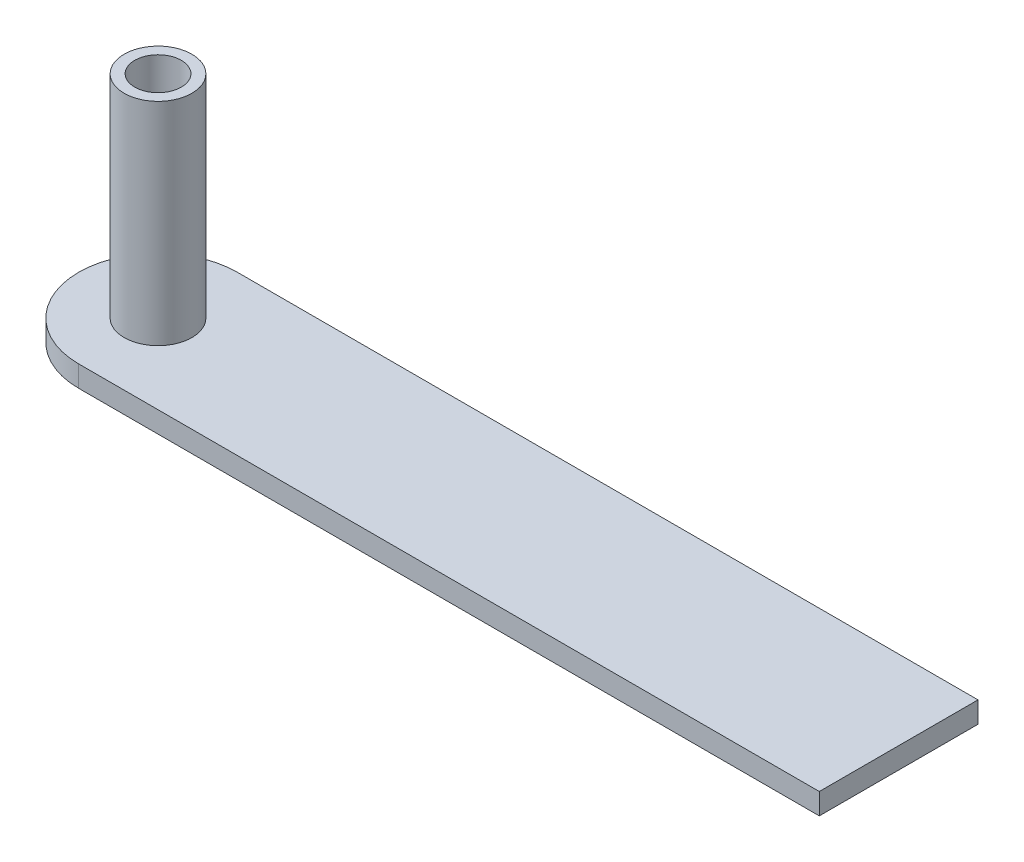
ISO-10303-21;
HEADER;
FILE_DESCRIPTION(('STEP AP214'),'2;1');
FILE_NAME('part.step','',(''),(''),'','','');
FILE_SCHEMA(('AUTOMOTIVE_DESIGN { 1 0 10303 214 1 1 1 1 }'));
ENDSEC;
DATA;
#1=APPLICATION_CONTEXT('core data for automotive mechanical design processes');
#2=APPLICATION_PROTOCOL_DEFINITION('international standard','automotive_design',2000,#1);
#3=PRODUCT_CONTEXT('',#1,'mechanical');
#4=PRODUCT('Part','Part','',(#3));
#5=PRODUCT_RELATED_PRODUCT_CATEGORY('part','',(#4));
#6=PRODUCT_DEFINITION_FORMATION('','',#4);
#7=PRODUCT_DEFINITION_CONTEXT('part definition',#1,'design');
#8=PRODUCT_DEFINITION('design','',#6,#7);
#9=PRODUCT_DEFINITION_SHAPE('','',#8);
#10=(LENGTH_UNIT() NAMED_UNIT(*) SI_UNIT(.MILLI.,.METRE.));
#11=(NAMED_UNIT(*) PLANE_ANGLE_UNIT() SI_UNIT($,.RADIAN.));
#12=(NAMED_UNIT(*) SI_UNIT($,.STERADIAN.) SOLID_ANGLE_UNIT());
#13=UNCERTAINTY_MEASURE_WITH_UNIT(LENGTH_MEASURE(1.E-05),#10,'distance_accuracy_value','');
#14=(GEOMETRIC_REPRESENTATION_CONTEXT(3) GLOBAL_UNCERTAINTY_ASSIGNED_CONTEXT((#13)) GLOBAL_UNIT_ASSIGNED_CONTEXT((#10,
#11,#12)) REPRESENTATION_CONTEXT('',''));
#15=CARTESIAN_POINT('',(0.,0.,0.));
#16=DIRECTION('',(0.,0.,1.));
#17=DIRECTION('',(1.,0.,0.));
#18=AXIS2_PLACEMENT_3D('',#15,#16,#17);
#19=CARTESIAN_POINT('',(0.,0.,-7.5));
#20=DIRECTION('',(0.,1.,0.));
#21=DIRECTION('',(0.,0.,1.));
#22=AXIS2_PLACEMENT_3D('',#19,#20,#21);
#23=CYLINDRICAL_SURFACE('',#22,2.);
#24=CARTESIAN_POINT('',(0.,18.,-7.5));
#25=DIRECTION('',(0.,1.,0.));
#26=DIRECTION('',(0.,0.,1.));
#27=AXIS2_PLACEMENT_3D('',#24,#25,#26);
#28=CIRCLE('',#27,2.);
#29=CARTESIAN_POINT('',(0.,18.,-5.5));
#30=VERTEX_POINT('',#29);
#31=EDGE_CURVE('E47',#30,#30,#28,.F.);
#32=ORIENTED_EDGE('',*,*,#31,.F.);
#33=EDGE_LOOP('',(#32));
#34=FACE_BOUND('',#33,.T.);
#35=CARTESIAN_POINT('',(0.,17.,-7.5));
#36=DIRECTION('',(0.,-1.,0.));
#37=DIRECTION('',(0.,0.,-1.));
#38=AXIS2_PLACEMENT_3D('',#35,#36,#37);
#39=CIRCLE('',#38,2.);
#40=CARTESIAN_POINT('',(0.,17.,-9.5));
#41=VERTEX_POINT('',#40);
#42=EDGE_CURVE('E150',#41,#41,#39,.T.);
#43=ORIENTED_EDGE('',*,*,#42,.T.);
#44=EDGE_LOOP('',(#43));
#45=FACE_BOUND('',#44,.T.);
#46=ADVANCED_FACE('F43',(#34,#45),#23,.F.);
#47=CARTESIAN_POINT('',(0.,2.,0.));
#48=DIRECTION('',(0.,0.,-1.));
#49=DIRECTION('',(-1.,0.,0.));
#50=AXIS2_PLACEMENT_3D('',#47,#48,#49);
#51=PLANE('',#50);
#52=DIRECTION('',(1.,0.,0.));
#53=VECTOR('',#52,1.);
#54=CARTESIAN_POINT('',(0.,0.,0.));
#55=LINE('',#54,#53);
#56=CARTESIAN_POINT('',(0.,0.,0.));
#57=VERTEX_POINT('',#56);
#58=CARTESIAN_POINT('',(70.,0.,0.));
#59=VERTEX_POINT('',#58);
#60=EDGE_CURVE('E86',#57,#59,#55,.T.);
#61=ORIENTED_EDGE('',*,*,#60,.T.);
#62=DIRECTION('',(0.,-1.,0.));
#63=VECTOR('',#62,1.);
#64=CARTESIAN_POINT('',(70.,2.,0.));
#65=LINE('',#64,#63);
#66=CARTESIAN_POINT('',(70.,2.,0.));
#67=VERTEX_POINT('',#66);
#68=EDGE_CURVE('E11',#67,#59,#65,.T.);
#69=ORIENTED_EDGE('',*,*,#68,.F.);
#70=DIRECTION('',(1.,0.,0.));
#71=VECTOR('',#70,1.);
#72=CARTESIAN_POINT('',(0.,2.,0.));
#73=LINE('',#72,#71);
#74=CARTESIAN_POINT('',(0.,2.,0.));
#75=VERTEX_POINT('',#74);
#76=EDGE_CURVE('E105',#75,#67,#73,.T.);
#77=ORIENTED_EDGE('',*,*,#76,.F.);
#78=DIRECTION('',(0.,-1.,0.));
#79=VECTOR('',#78,1.);
#80=CARTESIAN_POINT('',(0.,2.,0.));
#81=LINE('',#80,#79);
#82=EDGE_CURVE('E101',#75,#57,#81,.T.);
#83=ORIENTED_EDGE('',*,*,#82,.T.);
#84=EDGE_LOOP('',(#61,#69,#77,#83));
#85=FACE_BOUND('',#84,.T.);
#86=ADVANCED_FACE('F45',(#85),#51,.F.);
#87=CARTESIAN_POINT('',(70.,2.,0.));
#88=DIRECTION('',(-1.,0.,0.));
#89=DIRECTION('',(0.,0.,1.));
#90=AXIS2_PLACEMENT_3D('',#87,#88,#89);
#91=PLANE('',#90);
#92=DIRECTION('',(0.,0.,-1.));
#93=VECTOR('',#92,1.);
#94=CARTESIAN_POINT('',(70.,0.,0.));
#95=LINE('',#94,#93);
#96=CARTESIAN_POINT('',(70.,0.,-15.));
#97=VERTEX_POINT('',#96);
#98=EDGE_CURVE('E106',#59,#97,#95,.T.);
#99=ORIENTED_EDGE('',*,*,#98,.T.);
#100=DIRECTION('',(0.,-1.,0.));
#101=VECTOR('',#100,1.);
#102=CARTESIAN_POINT('',(70.,2.,-15.));
#103=LINE('',#102,#101);
#104=CARTESIAN_POINT('',(70.,2.,-15.));
#105=VERTEX_POINT('',#104);
#106=EDGE_CURVE('E54',#105,#97,#103,.T.);
#107=ORIENTED_EDGE('',*,*,#106,.F.);
#108=DIRECTION('',(0.,0.,-1.));
#109=VECTOR('',#108,1.);
#110=CARTESIAN_POINT('',(70.,2.,0.));
#111=LINE('',#110,#109);
#112=EDGE_CURVE('E62',#67,#105,#111,.T.);
#113=ORIENTED_EDGE('',*,*,#112,.F.);
#114=ORIENTED_EDGE('',*,*,#68,.T.);
#115=EDGE_LOOP('',(#99,#107,#113,#114));
#116=FACE_BOUND('',#115,.T.);
#117=ADVANCED_FACE('F190',(#116),#91,.F.);
#118=CARTESIAN_POINT('',(0.,2.,-15.));
#119=DIRECTION('',(0.,0.,-1.));
#120=DIRECTION('',(-1.,0.,0.));
#121=AXIS2_PLACEMENT_3D('',#118,#119,#120);
#122=PLANE('',#121);
#123=DIRECTION('',(1.,0.,0.));
#124=VECTOR('',#123,1.);
#125=CARTESIAN_POINT('',(0.,0.,-15.));
#126=LINE('',#125,#124);
#127=CARTESIAN_POINT('',(0.,0.,-15.));
#128=VERTEX_POINT('',#127);
#129=EDGE_CURVE('E84',#128,#97,#126,.T.);
#130=ORIENTED_EDGE('',*,*,#129,.F.);
#131=DIRECTION('',(0.,-1.,0.));
#132=VECTOR('',#131,1.);
#133=CARTESIAN_POINT('',(0.,2.,-15.));
#134=LINE('',#133,#132);
#135=CARTESIAN_POINT('',(0.,2.,-15.));
#136=VERTEX_POINT('',#135);
#137=EDGE_CURVE('E96',#136,#128,#134,.T.);
#138=ORIENTED_EDGE('',*,*,#137,.F.);
#139=DIRECTION('',(1.,0.,0.));
#140=VECTOR('',#139,1.);
#141=CARTESIAN_POINT('',(0.,2.,-15.));
#142=LINE('',#141,#140);
#143=EDGE_CURVE('E115',#136,#105,#142,.T.);
#144=ORIENTED_EDGE('',*,*,#143,.T.);
#145=ORIENTED_EDGE('',*,*,#106,.T.);
#146=EDGE_LOOP('',(#130,#138,#144,#145));
#147=FACE_BOUND('',#146,.T.);
#148=ADVANCED_FACE('F103',(#147),#122,.T.);
#149=CARTESIAN_POINT('',(0.,2.,0.));
#150=DIRECTION('',(0.,1.,0.));
#151=DIRECTION('',(0.,0.,1.));
#152=AXIS2_PLACEMENT_3D('',#149,#150,#151);
#153=PLANE('',#152);
#154=CARTESIAN_POINT('',(0.,2.,-7.5));
#155=DIRECTION('',(0.,1.,0.));
#156=DIRECTION('',(0.,0.,1.));
#157=AXIS2_PLACEMENT_3D('',#154,#155,#156);
#158=CIRCLE('',#157,3.2);
#159=CARTESIAN_POINT('',(0.,2.,-4.3));
#160=VERTEX_POINT('',#159);
#161=EDGE_CURVE('E130',#160,#160,#158,.T.);
#162=ORIENTED_EDGE('',*,*,#161,.F.);
#163=EDGE_LOOP('',(#162));
#164=FACE_BOUND('',#163,.T.);
#165=ORIENTED_EDGE('',*,*,#143,.F.);
#166=CARTESIAN_POINT('',(0.,2.,-7.5));
#167=DIRECTION('',(0.,1.,0.));
#168=DIRECTION('',(0.,0.,1.));
#169=AXIS2_PLACEMENT_3D('',#166,#167,#168);
#170=CIRCLE('',#169,7.5);
#171=EDGE_CURVE('E91',#136,#75,#170,.T.);
#172=ORIENTED_EDGE('',*,*,#171,.T.);
#173=ORIENTED_EDGE('',*,*,#76,.T.);
#174=ORIENTED_EDGE('',*,*,#112,.T.);
#175=EDGE_LOOP('',(#165,#172,#173,#174));
#176=FACE_BOUND('',#175,.T.);
#177=ADVANCED_FACE('F173',(#164,#176),#153,.T.);
#178=CARTESIAN_POINT('',(0.,0.,0.));
#179=DIRECTION('',(0.,1.,0.));
#180=DIRECTION('',(0.,0.,1.));
#181=AXIS2_PLACEMENT_3D('',#178,#179,#180);
#182=PLANE('',#181);
#183=CARTESIAN_POINT('',(0.,0.,-7.5));
#184=DIRECTION('',(0.,-1.,0.));
#185=DIRECTION('',(0.,0.,-1.));
#186=AXIS2_PLACEMENT_3D('',#183,#184,#185);
#187=CIRCLE('',#186,2.5);
#188=CARTESIAN_POINT('',(0.,0.,-10.));
#189=VERTEX_POINT('',#188);
#190=EDGE_CURVE('E146',#189,#189,#187,.T.);
#191=ORIENTED_EDGE('',*,*,#190,.F.);
#192=EDGE_LOOP('',(#191));
#193=FACE_BOUND('',#192,.T.);
#194=ORIENTED_EDGE('',*,*,#60,.F.);
#195=CARTESIAN_POINT('',(0.,0.,-7.5));
#196=DIRECTION('',(0.,1.,0.));
#197=DIRECTION('',(0.,0.,1.));
#198=AXIS2_PLACEMENT_3D('',#195,#196,#197);
#199=CIRCLE('',#198,7.5);
#200=EDGE_CURVE('E81',#128,#57,#199,.T.);
#201=ORIENTED_EDGE('',*,*,#200,.F.);
#202=ORIENTED_EDGE('',*,*,#129,.T.);
#203=ORIENTED_EDGE('',*,*,#98,.F.);
#204=EDGE_LOOP('',(#194,#201,#202,#203));
#205=FACE_BOUND('',#204,.T.);
#206=ADVANCED_FACE('F83',(#193,#205),#182,.F.);
#207=CARTESIAN_POINT('',(0.,2.,-7.5));
#208=DIRECTION('',(0.,-1.,0.));
#209=DIRECTION('',(0.,0.,-1.));
#210=AXIS2_PLACEMENT_3D('',#207,#208,#209);
#211=CYLINDRICAL_SURFACE('',#210,7.5);
#212=ORIENTED_EDGE('',*,*,#137,.T.);
#213=ORIENTED_EDGE('',*,*,#200,.T.);
#214=ORIENTED_EDGE('',*,*,#82,.F.);
#215=ORIENTED_EDGE('',*,*,#171,.F.);
#216=EDGE_LOOP('',(#212,#213,#214,#215));
#217=FACE_BOUND('',#216,.T.);
#218=ADVANCED_FACE('F97',(#217),#211,.T.);
#219=CARTESIAN_POINT('',(0.,22.,-7.5));
#220=DIRECTION('',(0.,1.,0.));
#221=DIRECTION('',(0.,0.,1.));
#222=AXIS2_PLACEMENT_3D('',#219,#220,#221);
#223=PLANE('',#222);
#224=CARTESIAN_POINT('',(0.,22.,-7.5));
#225=DIRECTION('',(0.,1.,0.));
#226=DIRECTION('',(0.,0.,1.));
#227=AXIS2_PLACEMENT_3D('',#224,#225,#226);
#228=CIRCLE('',#227,2.2);
#229=CARTESIAN_POINT('',(0.,22.,-5.3));
#230=VERTEX_POINT('',#229);
#231=EDGE_CURVE('E137',#230,#230,#228,.T.);
#232=ORIENTED_EDGE('',*,*,#231,.F.);
#233=EDGE_LOOP('',(#232));
#234=FACE_BOUND('',#233,.T.);
#235=CARTESIAN_POINT('',(0.,22.,-7.5));
#236=DIRECTION('',(0.,1.,0.));
#237=DIRECTION('',(0.,0.,1.));
#238=AXIS2_PLACEMENT_3D('',#235,#236,#237);
#239=CIRCLE('',#238,3.2);
#240=CARTESIAN_POINT('',(0.,22.,-4.3));
#241=VERTEX_POINT('',#240);
#242=EDGE_CURVE('E92',#241,#241,#239,.T.);
#243=ORIENTED_EDGE('',*,*,#242,.T.);
#244=EDGE_LOOP('',(#243));
#245=FACE_BOUND('',#244,.T.);
#246=ADVANCED_FACE('F179',(#234,#245),#223,.T.);
#247=CARTESIAN_POINT('',(0.,22.,-7.5));
#248=DIRECTION('',(0.,-1.,0.));
#249=DIRECTION('',(0.,0.,-1.));
#250=AXIS2_PLACEMENT_3D('',#247,#248,#249);
#251=CYLINDRICAL_SURFACE('',#250,3.2);
#252=ORIENTED_EDGE('',*,*,#242,.F.);
#253=EDGE_LOOP('',(#252));
#254=FACE_BOUND('',#253,.T.);
#255=ORIENTED_EDGE('',*,*,#161,.T.);
#256=EDGE_LOOP('',(#255));
#257=FACE_BOUND('',#256,.T.);
#258=ADVANCED_FACE('F197',(#254,#257),#251,.T.);
#259=CARTESIAN_POINT('',(0.,18.,-7.5));
#260=DIRECTION('',(0.,1.,0.));
#261=DIRECTION('',(0.,0.,1.));
#262=AXIS2_PLACEMENT_3D('',#259,#260,#261);
#263=PLANE('',#262);
#264=CARTESIAN_POINT('',(0.,18.,-7.5));
#265=DIRECTION('',(0.,1.,0.));
#266=DIRECTION('',(0.,0.,1.));
#267=AXIS2_PLACEMENT_3D('',#264,#265,#266);
#268=CIRCLE('',#267,2.2);
#269=CARTESIAN_POINT('',(0.,18.,-5.3));
#270=VERTEX_POINT('',#269);
#271=EDGE_CURVE('E141',#270,#270,#268,.T.);
#272=ORIENTED_EDGE('',*,*,#271,.T.);
#273=EDGE_LOOP('',(#272));
#274=FACE_BOUND('',#273,.T.);
#275=ORIENTED_EDGE('',*,*,#31,.T.);
#276=EDGE_LOOP('',(#275));
#277=FACE_BOUND('',#276,.T.);
#278=ADVANCED_FACE('F200',(#274,#277),#263,.T.);
#279=CARTESIAN_POINT('',(0.,18.,-7.5));
#280=DIRECTION('',(0.,1.,0.));
#281=DIRECTION('',(0.,0.,1.));
#282=AXIS2_PLACEMENT_3D('',#279,#280,#281);
#283=CYLINDRICAL_SURFACE('',#282,2.2);
#284=ORIENTED_EDGE('',*,*,#271,.F.);
#285=EDGE_LOOP('',(#284));
#286=FACE_BOUND('',#285,.T.);
#287=ORIENTED_EDGE('',*,*,#231,.T.);
#288=EDGE_LOOP('',(#287));
#289=FACE_BOUND('',#288,.T.);
#290=ADVANCED_FACE('F168',(#286,#289),#283,.F.);
#291=CARTESIAN_POINT('',(0.,17.,-7.5));
#292=DIRECTION('',(0.,-1.,0.));
#293=DIRECTION('',(0.,0.,-1.));
#294=AXIS2_PLACEMENT_3D('',#291,#292,#293);
#295=CYLINDRICAL_SURFACE('',#294,2.5);
#296=CARTESIAN_POINT('',(0.,17.,-7.5));
#297=DIRECTION('',(0.,-1.,0.));
#298=DIRECTION('',(0.,0.,-1.));
#299=AXIS2_PLACEMENT_3D('',#296,#297,#298);
#300=CIRCLE('',#299,2.5);
#301=CARTESIAN_POINT('',(0.,17.,-10.));
#302=VERTEX_POINT('',#301);
#303=EDGE_CURVE('E142',#302,#302,#300,.T.);
#304=ORIENTED_EDGE('',*,*,#303,.F.);
#305=EDGE_LOOP('',(#304));
#306=FACE_BOUND('',#305,.T.);
#307=ORIENTED_EDGE('',*,*,#190,.T.);
#308=EDGE_LOOP('',(#307));
#309=FACE_BOUND('',#308,.T.);
#310=ADVANCED_FACE('F162',(#306,#309),#295,.F.);
#311=CARTESIAN_POINT('',(0.,17.,-7.5));
#312=DIRECTION('',(0.,-1.,0.));
#313=DIRECTION('',(0.,0.,-1.));
#314=AXIS2_PLACEMENT_3D('',#311,#312,#313);
#315=PLANE('',#314);
#316=ORIENTED_EDGE('',*,*,#42,.F.);
#317=EDGE_LOOP('',(#316));
#318=FACE_BOUND('',#317,.T.);
#319=ORIENTED_EDGE('',*,*,#303,.T.);
#320=EDGE_LOOP('',(#319));
#321=FACE_BOUND('',#320,.T.);
#322=ADVANCED_FACE('F159',(#318,#321),#315,.T.);
#323=CLOSED_SHELL('',(#46,#86,#117,#148,#177,#206,#218,#246,#258,#278,#290,#310,#322));
#324=MANIFOLD_SOLID_BREP('B2',#323);
#325=ADVANCED_BREP_SHAPE_REPRESENTATION('',(#18,#324),#14);
#326=SHAPE_DEFINITION_REPRESENTATION(#9,#325);
ENDSEC;
END-ISO-10303-21;
